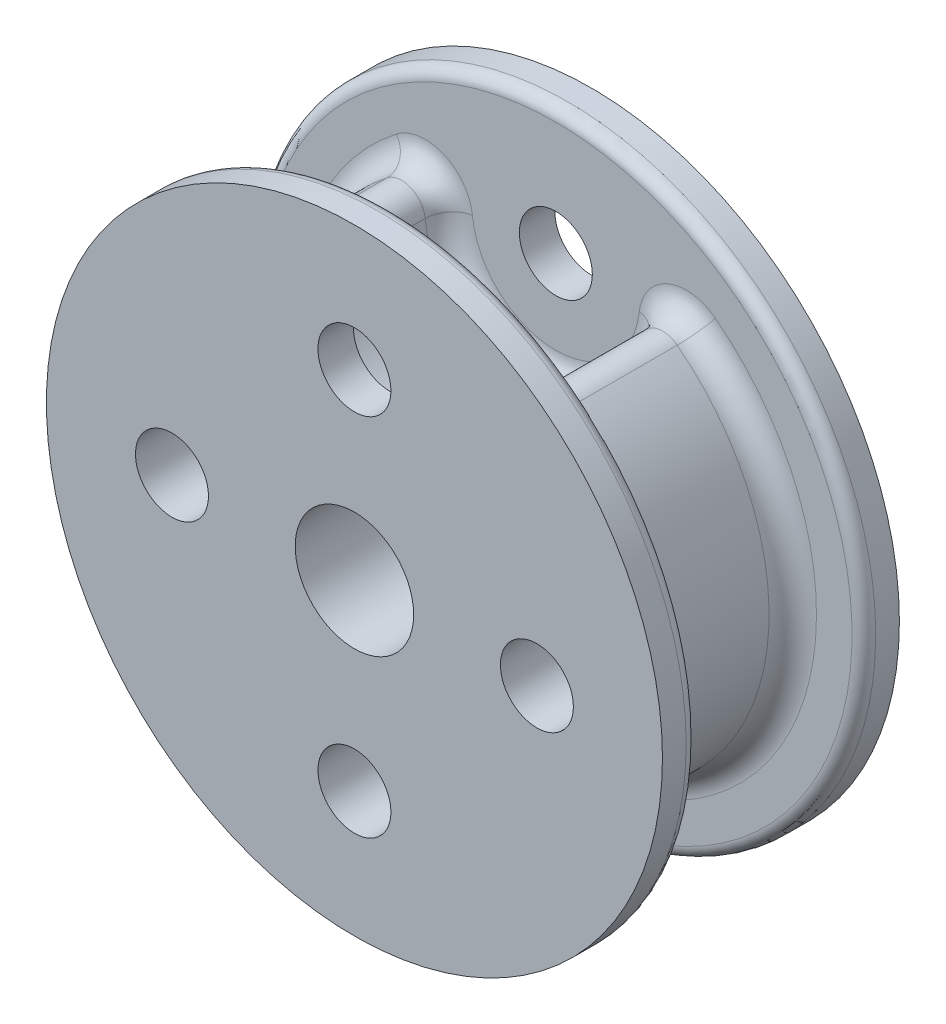
ISO-10303-21;
HEADER;
FILE_DESCRIPTION(('STEP AP214'),'2;1');
FILE_NAME('part.step','',(''),(''),'','','');
FILE_SCHEMA(('AUTOMOTIVE_DESIGN { 1 0 10303 214 1 1 1 1 }'));
ENDSEC;
DATA;
#1=APPLICATION_CONTEXT('core data for automotive mechanical design processes');
#2=APPLICATION_PROTOCOL_DEFINITION('international standard','automotive_design',2000,#1);
#3=PRODUCT_CONTEXT('',#1,'mechanical');
#4=PRODUCT('Part','Part','',(#3));
#5=PRODUCT_RELATED_PRODUCT_CATEGORY('part','',(#4));
#6=PRODUCT_DEFINITION_FORMATION('','',#4);
#7=PRODUCT_DEFINITION_CONTEXT('part definition',#1,'design');
#8=PRODUCT_DEFINITION('design','',#6,#7);
#9=PRODUCT_DEFINITION_SHAPE('','',#8);
#10=(LENGTH_UNIT() NAMED_UNIT(*) SI_UNIT(.MILLI.,.METRE.));
#11=(NAMED_UNIT(*) PLANE_ANGLE_UNIT() SI_UNIT($,.RADIAN.));
#12=(NAMED_UNIT(*) SI_UNIT($,.STERADIAN.) SOLID_ANGLE_UNIT());
#13=UNCERTAINTY_MEASURE_WITH_UNIT(LENGTH_MEASURE(1.E-05),#10,'distance_accuracy_value','');
#14=(GEOMETRIC_REPRESENTATION_CONTEXT(3) GLOBAL_UNCERTAINTY_ASSIGNED_CONTEXT((#13)) GLOBAL_UNIT_ASSIGNED_CONTEXT((#10,
#11,#12)) REPRESENTATION_CONTEXT('',''));
#15=CARTESIAN_POINT('',(0.,0.,0.));
#16=DIRECTION('',(0.,0.,1.));
#17=DIRECTION('',(1.,0.,0.));
#18=AXIS2_PLACEMENT_3D('',#15,#16,#17);
#19=CARTESIAN_POINT('',(0.,9.779,4.445));
#20=DIRECTION('',(0.,0.,-1.));
#21=DIRECTION('',(-1.,0.,0.));
#22=AXIS2_PLACEMENT_3D('',#19,#20,#21);
#23=CYLINDRICAL_SURFACE('',#22,5.7658);
#24=CARTESIAN_POINT('',(0.,9.779,3.175));
#25=DIRECTION('',(0.,0.,1.));
#26=DIRECTION('',(1.,0.,0.));
#27=AXIS2_PLACEMENT_3D('',#24,#25,#26);
#28=CIRCLE('',#27,5.7658);
#29=CARTESIAN_POINT('',(-5.73376060184355,9.17200823667307,3.175));
#30=VERTEX_POINT('',#29);
#31=CARTESIAN_POINT('',(5.73376060184355,9.17200823667307,3.175));
#32=VERTEX_POINT('',#31);
#33=EDGE_CURVE('E109',#30,#32,#28,.T.);
#34=ORIENTED_EDGE('',*,*,#33,.T.);
#35=DIRECTION('',(0.,0.,-1.));
#36=VECTOR('',#35,1.);
#37=CARTESIAN_POINT('',(5.73376060184355,9.17200823667307,4.445));
#38=LINE('',#37,#36);
#39=CARTESIAN_POINT('',(5.73376060184355,9.17200823667307,-3.175));
#40=VERTEX_POINT('',#39);
#41=EDGE_CURVE('E105',#32,#40,#38,.T.);
#42=ORIENTED_EDGE('',*,*,#41,.T.);
#43=CARTESIAN_POINT('',(0.,9.779,-3.175));
#44=DIRECTION('',(0.,0.,-1.));
#45=DIRECTION('',(-1.,0.,0.));
#46=AXIS2_PLACEMENT_3D('',#43,#44,#45);
#47=CIRCLE('',#46,5.7658);
#48=CARTESIAN_POINT('',(-5.73376060184355,9.17200823667307,-3.175));
#49=VERTEX_POINT('',#48);
#50=EDGE_CURVE('E98',#40,#49,#47,.T.);
#51=ORIENTED_EDGE('',*,*,#50,.T.);
#52=DIRECTION('',(0.,0.,-1.));
#53=VECTOR('',#52,1.);
#54=CARTESIAN_POINT('',(-5.73376060184355,9.17200823667307,4.445));
#55=LINE('',#54,#53);
#56=EDGE_CURVE('E102',#49,#30,#55,.F.);
#57=ORIENTED_EDGE('',*,*,#56,.T.);
#58=EDGE_LOOP('',(#34,#42,#51,#57));
#59=FACE_BOUND('',#58,.T.);
#60=ADVANCED_FACE('F35',(#59),#23,.F.);
#61=CARTESIAN_POINT('',(0.,-9.779,4.445));
#62=DIRECTION('',(0.,0.,-1.));
#63=DIRECTION('',(-1.,0.,0.));
#64=AXIS2_PLACEMENT_3D('',#61,#62,#63);
#65=CYLINDRICAL_SURFACE('',#64,1.9558);
#66=CARTESIAN_POINT('',(0.,-9.779,6.35));
#67=DIRECTION('',(0.,0.,1.));
#68=DIRECTION('',(1.,0.,0.));
#69=AXIS2_PLACEMENT_3D('',#66,#67,#68);
#70=CIRCLE('',#69,1.9558);
#71=CARTESIAN_POINT('',(1.9558,-9.779,6.35));
#72=VERTEX_POINT('',#71);
#73=EDGE_CURVE('E139',#72,#72,#70,.T.);
#74=ORIENTED_EDGE('',*,*,#73,.T.);
#75=EDGE_LOOP('',(#74));
#76=FACE_BOUND('',#75,.T.);
#77=CARTESIAN_POINT('',(0.,-9.779,-6.35));
#78=DIRECTION('',(0.,0.,1.));
#79=DIRECTION('',(1.,0.,0.));
#80=AXIS2_PLACEMENT_3D('',#77,#78,#79);
#81=CIRCLE('',#80,1.9558);
#82=CARTESIAN_POINT('',(1.9558,-9.779,-6.35));
#83=VERTEX_POINT('',#82);
#84=EDGE_CURVE('E321',#83,#83,#81,.T.);
#85=ORIENTED_EDGE('',*,*,#84,.F.);
#86=EDGE_LOOP('',(#85));
#87=FACE_BOUND('',#86,.T.);
#88=ADVANCED_FACE('F208',(#76,#87),#65,.F.);
#89=CARTESIAN_POINT('',(-9.779,0.,4.445));
#90=DIRECTION('',(0.,0.,-1.));
#91=DIRECTION('',(-1.,0.,0.));
#92=AXIS2_PLACEMENT_3D('',#89,#90,#91);
#93=CYLINDRICAL_SURFACE('',#92,1.9558);
#94=CARTESIAN_POINT('',(-9.779,0.,6.35));
#95=DIRECTION('',(0.,0.,1.));
#96=DIRECTION('',(1.,0.,0.));
#97=AXIS2_PLACEMENT_3D('',#94,#95,#96);
#98=CIRCLE('',#97,1.9558);
#99=CARTESIAN_POINT('',(-7.8232,0.,6.35));
#100=VERTEX_POINT('',#99);
#101=EDGE_CURVE('E304',#100,#100,#98,.T.);
#102=ORIENTED_EDGE('',*,*,#101,.T.);
#103=EDGE_LOOP('',(#102));
#104=FACE_BOUND('',#103,.T.);
#105=CARTESIAN_POINT('',(-9.779,0.,-6.35));
#106=DIRECTION('',(0.,0.,1.));
#107=DIRECTION('',(1.,0.,0.));
#108=AXIS2_PLACEMENT_3D('',#105,#106,#107);
#109=CIRCLE('',#108,1.9558);
#110=CARTESIAN_POINT('',(-7.8232,0.,-6.35));
#111=VERTEX_POINT('',#110);
#112=EDGE_CURVE('E307',#111,#111,#109,.T.);
#113=ORIENTED_EDGE('',*,*,#112,.F.);
#114=EDGE_LOOP('',(#113));
#115=FACE_BOUND('',#114,.T.);
#116=ADVANCED_FACE('F213',(#104,#115),#93,.F.);
#117=CARTESIAN_POINT('',(0.,0.,4.445));
#118=DIRECTION('',(0.,0.,-1.));
#119=DIRECTION('',(-1.,0.,0.));
#120=AXIS2_PLACEMENT_3D('',#117,#118,#119);
#121=CYLINDRICAL_SURFACE('',#120,12.7);
#122=DIRECTION('',(0.,0.,-1.));
#123=VECTOR('',#122,1.);
#124=CARTESIAN_POINT('',(-7.77411496187304,10.0425662337662,4.445));
#125=LINE('',#124,#123);
#126=CARTESIAN_POINT('',(-7.77411496187304,10.0425662337662,3.175));
#127=VERTEX_POINT('',#126);
#128=CARTESIAN_POINT('',(-7.77411496187304,10.0425662337662,-3.175));
#129=VERTEX_POINT('',#128);
#130=EDGE_CURVE('E55',#127,#129,#125,.T.);
#131=ORIENTED_EDGE('',*,*,#130,.T.);
#132=CARTESIAN_POINT('',(0.,0.,-3.175));
#133=DIRECTION('',(0.,0.,-1.));
#134=DIRECTION('',(-1.,0.,0.));
#135=AXIS2_PLACEMENT_3D('',#132,#133,#134);
#136=CIRCLE('',#135,12.7);
#137=CARTESIAN_POINT('',(7.77411496187304,10.0425662337662,-3.175));
#138=VERTEX_POINT('',#137);
#139=EDGE_CURVE('E50',#129,#138,#136,.F.);
#140=ORIENTED_EDGE('',*,*,#139,.T.);
#141=DIRECTION('',(0.,0.,-1.));
#142=VECTOR('',#141,1.);
#143=CARTESIAN_POINT('',(7.77411496187304,10.0425662337662,4.445));
#144=LINE('',#143,#142);
#145=CARTESIAN_POINT('',(7.77411496187304,10.0425662337662,3.175));
#146=VERTEX_POINT('',#145);
#147=EDGE_CURVE('E156',#138,#146,#144,.F.);
#148=ORIENTED_EDGE('',*,*,#147,.T.);
#149=CARTESIAN_POINT('',(0.,0.,3.175));
#150=DIRECTION('',(0.,0.,1.));
#151=DIRECTION('',(1.,0.,0.));
#152=AXIS2_PLACEMENT_3D('',#149,#150,#151);
#153=CIRCLE('',#152,12.7);
#154=EDGE_CURVE('E153',#146,#127,#153,.F.);
#155=ORIENTED_EDGE('',*,*,#154,.T.);
#156=EDGE_LOOP('',(#131,#140,#148,#155));
#157=FACE_BOUND('',#156,.T.);
#158=ADVANCED_FACE('F218',(#157),#121,.T.);
#159=CARTESIAN_POINT('',(0.,0.,4.445));
#160=DIRECTION('',(0.,0.,-1.));
#161=DIRECTION('',(-1.,0.,0.));
#162=AXIS2_PLACEMENT_3D('',#159,#160,#161);
#163=CYLINDRICAL_SURFACE('',#162,3.175);
#164=CARTESIAN_POINT('',(0.,0.,6.35));
#165=DIRECTION('',(0.,0.,1.));
#166=DIRECTION('',(1.,0.,0.));
#167=AXIS2_PLACEMENT_3D('',#164,#165,#166);
#168=CIRCLE('',#167,3.175);
#169=CARTESIAN_POINT('',(3.175,0.,6.35));
#170=VERTEX_POINT('',#169);
#171=EDGE_CURVE('E334',#170,#170,#168,.T.);
#172=ORIENTED_EDGE('',*,*,#171,.T.);
#173=EDGE_LOOP('',(#172));
#174=FACE_BOUND('',#173,.T.);
#175=CARTESIAN_POINT('',(0.,0.,-6.35));
#176=DIRECTION('',(0.,0.,1.));
#177=DIRECTION('',(1.,0.,0.));
#178=AXIS2_PLACEMENT_3D('',#175,#176,#177);
#179=CIRCLE('',#178,3.175);
#180=CARTESIAN_POINT('',(3.175,0.,-6.35));
#181=VERTEX_POINT('',#180);
#182=EDGE_CURVE('E309',#181,#181,#179,.T.);
#183=ORIENTED_EDGE('',*,*,#182,.F.);
#184=EDGE_LOOP('',(#183));
#185=FACE_BOUND('',#184,.T.);
#186=ADVANCED_FACE('F220',(#174,#185),#163,.F.);
#187=CARTESIAN_POINT('',(9.779,0.,4.445));
#188=DIRECTION('',(0.,0.,-1.));
#189=DIRECTION('',(-1.,0.,0.));
#190=AXIS2_PLACEMENT_3D('',#187,#188,#189);
#191=CYLINDRICAL_SURFACE('',#190,1.9558);
#192=CARTESIAN_POINT('',(9.779,0.,6.35));
#193=DIRECTION('',(0.,0.,1.));
#194=DIRECTION('',(1.,0.,0.));
#195=AXIS2_PLACEMENT_3D('',#192,#193,#194);
#196=CIRCLE('',#195,1.9558);
#197=CARTESIAN_POINT('',(11.7348,0.,6.35));
#198=VERTEX_POINT('',#197);
#199=EDGE_CURVE('E337',#198,#198,#196,.T.);
#200=ORIENTED_EDGE('',*,*,#199,.T.);
#201=EDGE_LOOP('',(#200));
#202=FACE_BOUND('',#201,.T.);
#203=CARTESIAN_POINT('',(9.779,0.,-6.35));
#204=DIRECTION('',(0.,0.,1.));
#205=DIRECTION('',(1.,0.,0.));
#206=AXIS2_PLACEMENT_3D('',#203,#204,#205);
#207=CIRCLE('',#206,1.9558);
#208=CARTESIAN_POINT('',(11.7348,0.,-6.35));
#209=VERTEX_POINT('',#208);
#210=EDGE_CURVE('E313',#209,#209,#207,.T.);
#211=ORIENTED_EDGE('',*,*,#210,.F.);
#212=EDGE_LOOP('',(#211));
#213=FACE_BOUND('',#212,.T.);
#214=ADVANCED_FACE('F223',(#202,#213),#191,.F.);
#215=CARTESIAN_POINT('',(0.,0.,4.445));
#216=DIRECTION('',(0.,0.,1.));
#217=DIRECTION('',(1.,0.,0.));
#218=AXIS2_PLACEMENT_3D('',#215,#216,#217);
#219=PLANE('',#218);
#220=CARTESIAN_POINT('',(0.,0.,4.445));
#221=DIRECTION('',(0.,0.,1.));
#222=DIRECTION('',(1.,0.,0.));
#223=AXIS2_PLACEMENT_3D('',#220,#221,#222);
#224=CIRCLE('',#223,15.875);
#225=CARTESIAN_POINT('',(15.875,0.,4.445));
#226=VERTEX_POINT('',#225);
#227=EDGE_CURVE('E190',#226,#226,#224,.F.);
#228=ORIENTED_EDGE('',*,*,#227,.T.);
#229=EDGE_LOOP('',(#228));
#230=FACE_BOUND('',#229,.T.);
#231=CARTESIAN_POINT('',(0.,0.,4.445));
#232=DIRECTION('',(0.,0.,1.));
#233=DIRECTION('',(1.,0.,0.));
#234=AXIS2_PLACEMENT_3D('',#231,#232,#233);
#235=CIRCLE('',#234,13.97);
#236=CARTESIAN_POINT('',(-8.55152645806035,11.0468228571429,4.445));
#237=VERTEX_POINT('',#236);
#238=CARTESIAN_POINT('',(8.55152645806035,11.0468228571429,4.445));
#239=VERTEX_POINT('',#238);
#240=EDGE_CURVE('E145',#237,#239,#235,.T.);
#241=ORIENTED_EDGE('',*,*,#240,.T.);
#242=CARTESIAN_POINT('',(6.99670346568574,9.03830961038961,4.445));
#243=DIRECTION('',(0.,0.,1.));
#244=DIRECTION('',(1.,0.,0.));
#245=AXIS2_PLACEMENT_3D('',#242,#243,#244);
#246=CIRCLE('',#245,2.54);
#247=CARTESIAN_POINT('',(4.47081773800136,9.30570686295654,4.445));
#248=VERTEX_POINT('',#247);
#249=EDGE_CURVE('E165',#239,#248,#246,.T.);
#250=ORIENTED_EDGE('',*,*,#249,.T.);
#251=CARTESIAN_POINT('',(0.,9.779,4.445));
#252=DIRECTION('',(0.,0.,1.));
#253=DIRECTION('',(1.,0.,0.));
#254=AXIS2_PLACEMENT_3D('',#251,#252,#253);
#255=CIRCLE('',#254,4.4958);
#256=CARTESIAN_POINT('',(-4.47081773800136,9.30570686295654,4.445));
#257=VERTEX_POINT('',#256);
#258=EDGE_CURVE('E147',#248,#257,#255,.F.);
#259=ORIENTED_EDGE('',*,*,#258,.T.);
#260=CARTESIAN_POINT('',(-6.99670346568574,9.03830961038961,4.445));
#261=DIRECTION('',(0.,0.,1.));
#262=DIRECTION('',(1.,0.,0.));
#263=AXIS2_PLACEMENT_3D('',#260,#261,#262);
#264=CIRCLE('',#263,2.54);
#265=EDGE_CURVE('E159',#257,#237,#264,.T.);
#266=ORIENTED_EDGE('',*,*,#265,.T.);
#267=EDGE_LOOP('',(#241,#250,#259,#266));
#268=FACE_BOUND('',#267,.T.);
#269=CARTESIAN_POINT('',(0.,9.779,4.445));
#270=DIRECTION('',(0.,0.,1.));
#271=DIRECTION('',(1.,0.,0.));
#272=AXIS2_PLACEMENT_3D('',#269,#270,#271);
#273=CIRCLE('',#272,1.9558);
#274=CARTESIAN_POINT('',(1.9558,9.779,4.445));
#275=VERTEX_POINT('',#274);
#276=EDGE_CURVE('E327',#275,#275,#273,.T.);
#277=ORIENTED_EDGE('',*,*,#276,.T.);
#278=EDGE_LOOP('',(#277));
#279=FACE_BOUND('',#278,.T.);
#280=ADVANCED_FACE('F286',(#230,#268,#279),#219,.F.);
#281=CARTESIAN_POINT('',(0.,0.,6.35));
#282=DIRECTION('',(0.,0.,1.));
#283=DIRECTION('',(1.,0.,0.));
#284=AXIS2_PLACEMENT_3D('',#281,#282,#283);
#285=PLANE('',#284);
#286=ORIENTED_EDGE('',*,*,#101,.F.);
#287=EDGE_LOOP('',(#286));
#288=FACE_BOUND('',#287,.T.);
#289=ORIENTED_EDGE('',*,*,#199,.F.);
#290=EDGE_LOOP('',(#289));
#291=FACE_BOUND('',#290,.T.);
#292=CARTESIAN_POINT('',(0.,0.,6.35));
#293=DIRECTION('',(0.,0.,1.));
#294=DIRECTION('',(1.,0.,0.));
#295=AXIS2_PLACEMENT_3D('',#292,#293,#294);
#296=CIRCLE('',#295,16.51);
#297=CARTESIAN_POINT('',(16.51,0.,6.35));
#298=VERTEX_POINT('',#297);
#299=EDGE_CURVE('E136',#298,#298,#296,.T.);
#300=ORIENTED_EDGE('',*,*,#299,.T.);
#301=EDGE_LOOP('',(#300));
#302=FACE_BOUND('',#301,.T.);
#303=ORIENTED_EDGE('',*,*,#73,.F.);
#304=EDGE_LOOP('',(#303));
#305=FACE_BOUND('',#304,.T.);
#306=ORIENTED_EDGE('',*,*,#171,.F.);
#307=EDGE_LOOP('',(#306));
#308=FACE_BOUND('',#307,.T.);
#309=CARTESIAN_POINT('',(0.,9.779,6.35));
#310=DIRECTION('',(0.,0.,1.));
#311=DIRECTION('',(1.,0.,0.));
#312=AXIS2_PLACEMENT_3D('',#309,#310,#311);
#313=CIRCLE('',#312,1.9558);
#314=CARTESIAN_POINT('',(1.9558,9.779,6.35));
#315=VERTEX_POINT('',#314);
#316=EDGE_CURVE('E328',#315,#315,#313,.T.);
#317=ORIENTED_EDGE('',*,*,#316,.F.);
#318=EDGE_LOOP('',(#317));
#319=FACE_BOUND('',#318,.T.);
#320=ADVANCED_FACE('F283',(#288,#291,#302,#305,#308,#319),#285,.T.);
#321=CARTESIAN_POINT('',(0.,0.,6.35));
#322=DIRECTION('',(0.,0.,-1.));
#323=DIRECTION('',(-1.,0.,0.));
#324=AXIS2_PLACEMENT_3D('',#321,#322,#323);
#325=CYLINDRICAL_SURFACE('',#324,16.51);
#326=CARTESIAN_POINT('',(0.,0.,5.08));
#327=DIRECTION('',(0.,0.,1.));
#328=DIRECTION('',(1.,0.,0.));
#329=AXIS2_PLACEMENT_3D('',#326,#327,#328);
#330=CIRCLE('',#329,16.51);
#331=CARTESIAN_POINT('',(16.51,0.,5.08));
#332=VERTEX_POINT('',#331);
#333=EDGE_CURVE('E167',#332,#332,#330,.T.);
#334=ORIENTED_EDGE('',*,*,#333,.T.);
#335=EDGE_LOOP('',(#334));
#336=FACE_BOUND('',#335,.T.);
#337=ORIENTED_EDGE('',*,*,#299,.F.);
#338=EDGE_LOOP('',(#337));
#339=FACE_BOUND('',#338,.T.);
#340=ADVANCED_FACE('F281',(#336,#339),#325,.T.);
#341=CARTESIAN_POINT('',(0.,9.779,6.35));
#342=DIRECTION('',(0.,0.,-1.));
#343=DIRECTION('',(-1.,0.,0.));
#344=AXIS2_PLACEMENT_3D('',#341,#342,#343);
#345=CYLINDRICAL_SURFACE('',#344,1.9558);
#346=ORIENTED_EDGE('',*,*,#316,.T.);
#347=EDGE_LOOP('',(#346));
#348=FACE_BOUND('',#347,.T.);
#349=ORIENTED_EDGE('',*,*,#276,.F.);
#350=EDGE_LOOP('',(#349));
#351=FACE_BOUND('',#350,.T.);
#352=ADVANCED_FACE('F275',(#348,#351),#345,.F.);
#353=CARTESIAN_POINT('',(0.,0.,-4.445));
#354=DIRECTION('',(0.,0.,-1.));
#355=DIRECTION('',(1.,0.,0.));
#356=AXIS2_PLACEMENT_3D('',#353,#354,#355);
#357=PLANE('',#356);
#358=CARTESIAN_POINT('',(0.,0.,-4.445));
#359=DIRECTION('',(0.,0.,-1.));
#360=DIRECTION('',(-1.,0.,0.));
#361=AXIS2_PLACEMENT_3D('',#358,#359,#360);
#362=CIRCLE('',#361,15.875);
#363=CARTESIAN_POINT('',(-15.875,0.,-4.445));
#364=VERTEX_POINT('',#363);
#365=EDGE_CURVE('E43',#364,#364,#362,.F.);
#366=ORIENTED_EDGE('',*,*,#365,.T.);
#367=EDGE_LOOP('',(#366));
#368=FACE_BOUND('',#367,.T.);
#369=CARTESIAN_POINT('',(0.,0.,-4.445));
#370=DIRECTION('',(0.,0.,-1.));
#371=DIRECTION('',(-1.,0.,0.));
#372=AXIS2_PLACEMENT_3D('',#369,#370,#371);
#373=CIRCLE('',#372,13.97);
#374=CARTESIAN_POINT('',(8.55152645806035,11.0468228571429,-4.445));
#375=VERTEX_POINT('',#374);
#376=CARTESIAN_POINT('',(-8.55152645806035,11.0468228571429,-4.445));
#377=VERTEX_POINT('',#376);
#378=EDGE_CURVE('E150',#375,#377,#373,.T.);
#379=ORIENTED_EDGE('',*,*,#378,.T.);
#380=CARTESIAN_POINT('',(-6.99670346568574,9.03830961038961,-4.445));
#381=DIRECTION('',(0.,0.,-1.));
#382=DIRECTION('',(-1.,0.,0.));
#383=AXIS2_PLACEMENT_3D('',#380,#381,#382);
#384=CIRCLE('',#383,2.54);
#385=CARTESIAN_POINT('',(-4.47081773800136,9.30570686295654,-4.445));
#386=VERTEX_POINT('',#385);
#387=EDGE_CURVE('E163',#377,#386,#384,.T.);
#388=ORIENTED_EDGE('',*,*,#387,.T.);
#389=CARTESIAN_POINT('',(0.,9.779,-4.445));
#390=DIRECTION('',(0.,0.,-1.));
#391=DIRECTION('',(-1.,0.,0.));
#392=AXIS2_PLACEMENT_3D('',#389,#390,#391);
#393=CIRCLE('',#392,4.4958);
#394=CARTESIAN_POINT('',(4.47081773800136,9.30570686295654,-4.445));
#395=VERTEX_POINT('',#394);
#396=EDGE_CURVE('E117',#386,#395,#393,.F.);
#397=ORIENTED_EDGE('',*,*,#396,.T.);
#398=CARTESIAN_POINT('',(6.99670346568574,9.03830961038961,-4.445));
#399=DIRECTION('',(0.,0.,-1.));
#400=DIRECTION('',(-1.,0.,0.));
#401=AXIS2_PLACEMENT_3D('',#398,#399,#400);
#402=CIRCLE('',#401,2.54);
#403=EDGE_CURVE('E161',#395,#375,#402,.T.);
#404=ORIENTED_EDGE('',*,*,#403,.T.);
#405=EDGE_LOOP('',(#379,#388,#397,#404));
#406=FACE_BOUND('',#405,.T.);
#407=CARTESIAN_POINT('',(0.,9.779,-4.445));
#408=DIRECTION('',(0.,0.,1.));
#409=DIRECTION('',(1.,0.,0.));
#410=AXIS2_PLACEMENT_3D('',#407,#408,#409);
#411=CIRCLE('',#410,1.9558);
#412=CARTESIAN_POINT('',(1.9558,9.779,-4.445));
#413=VERTEX_POINT('',#412);
#414=EDGE_CURVE('E187',#413,#413,#411,.T.);
#415=ORIENTED_EDGE('',*,*,#414,.F.);
#416=EDGE_LOOP('',(#415));
#417=FACE_BOUND('',#416,.T.);
#418=ADVANCED_FACE('F195',(#368,#406,#417),#357,.F.);
#419=CARTESIAN_POINT('',(0.,0.,-6.35));
#420=DIRECTION('',(0.,0.,1.));
#421=DIRECTION('',(1.,0.,0.));
#422=AXIS2_PLACEMENT_3D('',#419,#420,#421);
#423=CYLINDRICAL_SURFACE('',#422,16.51);
#424=CARTESIAN_POINT('',(0.,0.,-5.08));
#425=DIRECTION('',(0.,0.,-1.));
#426=DIRECTION('',(-1.,0.,0.));
#427=AXIS2_PLACEMENT_3D('',#424,#425,#426);
#428=CIRCLE('',#427,16.51);
#429=CARTESIAN_POINT('',(-16.51,0.,-5.08));
#430=VERTEX_POINT('',#429);
#431=EDGE_CURVE('E11',#430,#430,#428,.T.);
#432=ORIENTED_EDGE('',*,*,#431,.T.);
#433=EDGE_LOOP('',(#432));
#434=FACE_BOUND('',#433,.T.);
#435=CARTESIAN_POINT('',(0.,0.,-6.35));
#436=DIRECTION('',(0.,0.,1.));
#437=DIRECTION('',(1.,0.,0.));
#438=AXIS2_PLACEMENT_3D('',#435,#436,#437);
#439=CIRCLE('',#438,16.51);
#440=CARTESIAN_POINT('',(16.51,0.,-6.35));
#441=VERTEX_POINT('',#440);
#442=EDGE_CURVE('E324',#441,#441,#439,.T.);
#443=ORIENTED_EDGE('',*,*,#442,.T.);
#444=EDGE_LOOP('',(#443));
#445=FACE_BOUND('',#444,.T.);
#446=ADVANCED_FACE('F267',(#434,#445),#423,.T.);
#447=CARTESIAN_POINT('',(0.,0.,-6.35));
#448=DIRECTION('',(0.,0.,-1.));
#449=DIRECTION('',(1.,0.,0.));
#450=AXIS2_PLACEMENT_3D('',#447,#448,#449);
#451=PLANE('',#450);
#452=CARTESIAN_POINT('',(0.,9.779,-6.35));
#453=DIRECTION('',(0.,0.,1.));
#454=DIRECTION('',(1.,0.,0.));
#455=AXIS2_PLACEMENT_3D('',#452,#453,#454);
#456=CIRCLE('',#455,1.9558);
#457=CARTESIAN_POINT('',(1.9558,9.779,-6.35));
#458=VERTEX_POINT('',#457);
#459=EDGE_CURVE('E310',#458,#458,#456,.T.);
#460=ORIENTED_EDGE('',*,*,#459,.T.);
#461=EDGE_LOOP('',(#460));
#462=FACE_BOUND('',#461,.T.);
#463=ORIENTED_EDGE('',*,*,#112,.T.);
#464=EDGE_LOOP('',(#463));
#465=FACE_BOUND('',#464,.T.);
#466=ORIENTED_EDGE('',*,*,#182,.T.);
#467=EDGE_LOOP('',(#466));
#468=FACE_BOUND('',#467,.T.);
#469=ORIENTED_EDGE('',*,*,#210,.T.);
#470=EDGE_LOOP('',(#469));
#471=FACE_BOUND('',#470,.T.);
#472=ORIENTED_EDGE('',*,*,#84,.T.);
#473=EDGE_LOOP('',(#472));
#474=FACE_BOUND('',#473,.T.);
#475=ORIENTED_EDGE('',*,*,#442,.F.);
#476=EDGE_LOOP('',(#475));
#477=FACE_BOUND('',#476,.T.);
#478=ADVANCED_FACE('F261',(#462,#465,#468,#471,#474,#477),#451,.T.);
#479=CARTESIAN_POINT('',(0.,9.779,-6.35));
#480=DIRECTION('',(0.,0.,1.));
#481=DIRECTION('',(1.,0.,0.));
#482=AXIS2_PLACEMENT_3D('',#479,#480,#481);
#483=CYLINDRICAL_SURFACE('',#482,1.9558);
#484=ORIENTED_EDGE('',*,*,#459,.F.);
#485=EDGE_LOOP('',(#484));
#486=FACE_BOUND('',#485,.T.);
#487=ORIENTED_EDGE('',*,*,#414,.T.);
#488=EDGE_LOOP('',(#487));
#489=FACE_BOUND('',#488,.T.);
#490=ADVANCED_FACE('F257',(#486,#489),#483,.F.);
#491=CARTESIAN_POINT('',(0.,9.779,-3.175));
#492=DIRECTION('',(0.,0.,-1.));
#493=DIRECTION('',(-1.,0.,0.));
#494=AXIS2_PLACEMENT_3D('',#491,#492,#493);
#495=TOROIDAL_SURFACE('',#494,4.4958,1.27);
#496=CARTESIAN_POINT('',(4.47081773800136,9.30570686295654,-3.175));
#497=DIRECTION('',(-0.105274508884617,-0.994443199875741,0.));
#498=DIRECTION('',(0.994443199875741,-0.105274508884617,0.));
#499=AXIS2_PLACEMENT_3D('',#496,#497,#498);
#500=CIRCLE('',#499,1.27);
#501=EDGE_CURVE('E121',#395,#40,#500,.T.);
#502=ORIENTED_EDGE('',*,*,#501,.F.);
#503=ORIENTED_EDGE('',*,*,#396,.F.);
#504=CARTESIAN_POINT('',(-4.47081773800136,9.30570686295654,-3.175));
#505=DIRECTION('',(0.105274508884617,-0.994443199875741,0.));
#506=DIRECTION('',(0.994443199875741,0.105274508884617,0.));
#507=AXIS2_PLACEMENT_3D('',#504,#505,#506);
#508=CIRCLE('',#507,1.27);
#509=EDGE_CURVE('E113',#49,#386,#508,.T.);
#510=ORIENTED_EDGE('',*,*,#509,.F.);
#511=ORIENTED_EDGE('',*,*,#50,.F.);
#512=EDGE_LOOP('',(#502,#503,#510,#511));
#513=FACE_BOUND('',#512,.T.);
#514=ADVANCED_FACE('F115',(#513),#495,.F.);
#515=CARTESIAN_POINT('',(0.,0.,-3.175));
#516=DIRECTION('',(0.,0.,-1.));
#517=DIRECTION('',(-1.,0.,0.));
#518=AXIS2_PLACEMENT_3D('',#515,#516,#517);
#519=TOROIDAL_SURFACE('',#518,13.97,1.27);
#520=CARTESIAN_POINT('',(-8.55152645806035,11.0468228571429,-3.175));
#521=DIRECTION('',(-0.790753246753247,-0.612135036367956,0.));
#522=DIRECTION('',(0.612135036367956,-0.790753246753247,0.));
#523=AXIS2_PLACEMENT_3D('',#520,#521,#522);
#524=CIRCLE('',#523,1.27);
#525=EDGE_CURVE('E120',#377,#129,#524,.T.);
#526=ORIENTED_EDGE('',*,*,#525,.F.);
#527=ORIENTED_EDGE('',*,*,#378,.F.);
#528=CARTESIAN_POINT('',(8.55152645806035,11.0468228571429,-3.175));
#529=DIRECTION('',(0.790753246753247,-0.612135036367956,0.));
#530=DIRECTION('',(0.612135036367956,0.790753246753247,0.));
#531=AXIS2_PLACEMENT_3D('',#528,#529,#530);
#532=CIRCLE('',#531,1.27);
#533=EDGE_CURVE('E129',#138,#375,#532,.T.);
#534=ORIENTED_EDGE('',*,*,#533,.F.);
#535=ORIENTED_EDGE('',*,*,#139,.F.);
#536=EDGE_LOOP('',(#526,#527,#534,#535));
#537=FACE_BOUND('',#536,.T.);
#538=ADVANCED_FACE('F252',(#537),#519,.F.);
#539=CARTESIAN_POINT('',(-6.99670346568574,9.03830961038961,-3.175));
#540=DIRECTION('',(0.,0.,-1.));
#541=DIRECTION('',(-1.,0.,0.));
#542=AXIS2_PLACEMENT_3D('',#539,#540,#541);
#543=TOROIDAL_SURFACE('',#542,2.54,1.27);
#544=ORIENTED_EDGE('',*,*,#387,.F.);
#545=ORIENTED_EDGE('',*,*,#525,.T.);
#546=CARTESIAN_POINT('',(-6.99670346568574,9.03830961038961,-3.175));
#547=DIRECTION('',(0.,0.,-1.));
#548=DIRECTION('',(-1.,0.,0.));
#549=AXIS2_PLACEMENT_3D('',#546,#547,#548);
#550=CIRCLE('',#549,1.27);
#551=EDGE_CURVE('E125',#49,#129,#550,.F.);
#552=ORIENTED_EDGE('',*,*,#551,.F.);
#553=ORIENTED_EDGE('',*,*,#509,.T.);
#554=EDGE_LOOP('',(#544,#545,#552,#553));
#555=FACE_BOUND('',#554,.T.);
#556=ADVANCED_FACE('F126',(#555),#543,.F.);
#557=CARTESIAN_POINT('',(6.99670346568574,9.03830961038961,-3.175));
#558=DIRECTION('',(0.,0.,-1.));
#559=DIRECTION('',(-1.,0.,0.));
#560=AXIS2_PLACEMENT_3D('',#557,#558,#559);
#561=TOROIDAL_SURFACE('',#560,2.54,1.27);
#562=ORIENTED_EDGE('',*,*,#403,.F.);
#563=ORIENTED_EDGE('',*,*,#501,.T.);
#564=CARTESIAN_POINT('',(6.99670346568574,9.03830961038961,-3.175));
#565=DIRECTION('',(0.,0.,-1.));
#566=DIRECTION('',(-1.,0.,0.));
#567=AXIS2_PLACEMENT_3D('',#564,#565,#566);
#568=CIRCLE('',#567,1.27);
#569=EDGE_CURVE('E130',#138,#40,#568,.F.);
#570=ORIENTED_EDGE('',*,*,#569,.F.);
#571=ORIENTED_EDGE('',*,*,#533,.T.);
#572=EDGE_LOOP('',(#562,#563,#570,#571));
#573=FACE_BOUND('',#572,.T.);
#574=ADVANCED_FACE('F246',(#573),#561,.F.);
#575=CARTESIAN_POINT('',(-6.99670346568574,9.03830961038961,4.445));
#576=DIRECTION('',(0.,0.,1.));
#577=DIRECTION('',(1.,0.,0.));
#578=AXIS2_PLACEMENT_3D('',#575,#576,#577);
#579=CYLINDRICAL_SURFACE('',#578,1.27);
#580=ORIENTED_EDGE('',*,*,#551,.T.);
#581=ORIENTED_EDGE('',*,*,#130,.F.);
#582=CARTESIAN_POINT('',(-6.99670346568574,9.03830961038961,3.175));
#583=DIRECTION('',(0.,0.,1.));
#584=DIRECTION('',(1.,0.,0.));
#585=AXIS2_PLACEMENT_3D('',#582,#583,#584);
#586=CIRCLE('',#585,1.27);
#587=EDGE_CURVE('E134',#30,#127,#586,.T.);
#588=ORIENTED_EDGE('',*,*,#587,.F.);
#589=ORIENTED_EDGE('',*,*,#56,.F.);
#590=EDGE_LOOP('',(#580,#581,#588,#589));
#591=FACE_BOUND('',#590,.T.);
#592=ADVANCED_FACE('F132',(#591),#579,.T.);
#593=CARTESIAN_POINT('',(6.99670346568574,9.03830961038961,4.445));
#594=DIRECTION('',(0.,0.,1.));
#595=DIRECTION('',(1.,0.,0.));
#596=AXIS2_PLACEMENT_3D('',#593,#594,#595);
#597=CYLINDRICAL_SURFACE('',#596,1.27);
#598=ORIENTED_EDGE('',*,*,#569,.T.);
#599=ORIENTED_EDGE('',*,*,#41,.F.);
#600=CARTESIAN_POINT('',(6.99670346568574,9.03830961038961,3.175));
#601=DIRECTION('',(0.,0.,1.));
#602=DIRECTION('',(1.,0.,0.));
#603=AXIS2_PLACEMENT_3D('',#600,#601,#602);
#604=CIRCLE('',#603,1.27);
#605=EDGE_CURVE('E174',#146,#32,#604,.T.);
#606=ORIENTED_EDGE('',*,*,#605,.F.);
#607=ORIENTED_EDGE('',*,*,#147,.F.);
#608=EDGE_LOOP('',(#598,#599,#606,#607));
#609=FACE_BOUND('',#608,.T.);
#610=ADVANCED_FACE('F239',(#609),#597,.T.);
#611=CARTESIAN_POINT('',(0.,0.,3.175));
#612=DIRECTION('',(0.,0.,1.));
#613=DIRECTION('',(1.,0.,0.));
#614=AXIS2_PLACEMENT_3D('',#611,#612,#613);
#615=TOROIDAL_SURFACE('',#614,13.97,1.27);
#616=CARTESIAN_POINT('',(8.55152645806035,11.0468228571429,3.175));
#617=DIRECTION('',(0.790753246753247,-0.612135036367956,0.));
#618=DIRECTION('',(0.612135036367956,0.790753246753247,0.));
#619=AXIS2_PLACEMENT_3D('',#616,#617,#618);
#620=CIRCLE('',#619,1.27);
#621=EDGE_CURVE('E172',#239,#146,#620,.T.);
#622=ORIENTED_EDGE('',*,*,#621,.F.);
#623=ORIENTED_EDGE('',*,*,#240,.F.);
#624=CARTESIAN_POINT('',(-8.55152645806035,11.0468228571429,3.175));
#625=DIRECTION('',(-0.790753246753247,-0.612135036367956,0.));
#626=DIRECTION('',(0.612135036367956,-0.790753246753247,0.));
#627=AXIS2_PLACEMENT_3D('',#624,#625,#626);
#628=CIRCLE('',#627,1.27);
#629=EDGE_CURVE('E178',#127,#237,#628,.T.);
#630=ORIENTED_EDGE('',*,*,#629,.F.);
#631=ORIENTED_EDGE('',*,*,#154,.F.);
#632=EDGE_LOOP('',(#622,#623,#630,#631));
#633=FACE_BOUND('',#632,.T.);
#634=ADVANCED_FACE('F235',(#633),#615,.F.);
#635=CARTESIAN_POINT('',(-6.99670346568574,9.03830961038961,3.175));
#636=DIRECTION('',(0.,0.,1.));
#637=DIRECTION('',(1.,0.,0.));
#638=AXIS2_PLACEMENT_3D('',#635,#636,#637);
#639=TOROIDAL_SURFACE('',#638,2.54,1.27);
#640=ORIENTED_EDGE('',*,*,#629,.T.);
#641=ORIENTED_EDGE('',*,*,#265,.F.);
#642=CARTESIAN_POINT('',(-4.47081773800136,9.30570686295654,3.175));
#643=DIRECTION('',(0.105274508884617,-0.994443199875741,0.));
#644=DIRECTION('',(0.994443199875741,0.105274508884617,0.));
#645=AXIS2_PLACEMENT_3D('',#642,#643,#644);
#646=CIRCLE('',#645,1.27);
#647=EDGE_CURVE('E170',#30,#257,#646,.F.);
#648=ORIENTED_EDGE('',*,*,#647,.F.);
#649=ORIENTED_EDGE('',*,*,#587,.T.);
#650=EDGE_LOOP('',(#640,#641,#648,#649));
#651=FACE_BOUND('',#650,.T.);
#652=ADVANCED_FACE('F231',(#651),#639,.F.);
#653=CARTESIAN_POINT('',(6.99670346568574,9.03830961038961,3.175));
#654=DIRECTION('',(0.,0.,1.));
#655=DIRECTION('',(1.,0.,0.));
#656=AXIS2_PLACEMENT_3D('',#653,#654,#655);
#657=TOROIDAL_SURFACE('',#656,2.54,1.27);
#658=ORIENTED_EDGE('',*,*,#621,.T.);
#659=ORIENTED_EDGE('',*,*,#605,.T.);
#660=CARTESIAN_POINT('',(4.47081773800136,9.30570686295654,3.175));
#661=DIRECTION('',(-0.105274508884617,-0.994443199875741,0.));
#662=DIRECTION('',(0.994443199875741,-0.105274508884617,0.));
#663=AXIS2_PLACEMENT_3D('',#660,#661,#662);
#664=CIRCLE('',#663,1.27);
#665=EDGE_CURVE('E168',#248,#32,#664,.F.);
#666=ORIENTED_EDGE('',*,*,#665,.F.);
#667=ORIENTED_EDGE('',*,*,#249,.F.);
#668=EDGE_LOOP('',(#658,#659,#666,#667));
#669=FACE_BOUND('',#668,.T.);
#670=ADVANCED_FACE('F227',(#669),#657,.F.);
#671=CARTESIAN_POINT('',(0.,9.779,3.175));
#672=DIRECTION('',(0.,0.,1.));
#673=DIRECTION('',(1.,0.,0.));
#674=AXIS2_PLACEMENT_3D('',#671,#672,#673);
#675=TOROIDAL_SURFACE('',#674,4.4958,1.27);
#676=ORIENTED_EDGE('',*,*,#647,.T.);
#677=ORIENTED_EDGE('',*,*,#258,.F.);
#678=ORIENTED_EDGE('',*,*,#665,.T.);
#679=ORIENTED_EDGE('',*,*,#33,.F.);
#680=EDGE_LOOP('',(#676,#677,#678,#679));
#681=FACE_BOUND('',#680,.T.);
#682=ADVANCED_FACE('F204',(#681),#675,.F.);
#683=CARTESIAN_POINT('',(0.,0.,5.08));
#684=DIRECTION('',(0.,0.,1.));
#685=DIRECTION('',(1.,0.,0.));
#686=AXIS2_PLACEMENT_3D('',#683,#684,#685);
#687=TOROIDAL_SURFACE('',#686,15.875,0.635);
#688=ORIENTED_EDGE('',*,*,#227,.F.);
#689=EDGE_LOOP('',(#688));
#690=FACE_BOUND('',#689,.T.);
#691=ORIENTED_EDGE('',*,*,#333,.F.);
#692=EDGE_LOOP('',(#691));
#693=FACE_BOUND('',#692,.T.);
#694=ADVANCED_FACE('F199',(#690,#693),#687,.T.);
#695=CARTESIAN_POINT('',(0.,0.,-5.08));
#696=DIRECTION('',(0.,0.,-1.));
#697=DIRECTION('',(-1.,0.,0.));
#698=AXIS2_PLACEMENT_3D('',#695,#696,#697);
#699=TOROIDAL_SURFACE('',#698,15.875,0.635);
#700=ORIENTED_EDGE('',*,*,#431,.F.);
#701=EDGE_LOOP('',(#700));
#702=FACE_BOUND('',#701,.T.);
#703=ORIENTED_EDGE('',*,*,#365,.F.);
#704=EDGE_LOOP('',(#703));
#705=FACE_BOUND('',#704,.T.);
#706=ADVANCED_FACE('F37',(#702,#705),#699,.T.);
#707=CLOSED_SHELL('',(#60,#88,#116,#158,#186,#214,#280,#320,#340,#352,#418,#446,#478,#490,#514,
#538,#556,#574,#592,#610,#634,#652,#670,#682,#694,#706));
#708=MANIFOLD_SOLID_BREP('B2',#707);
#709=ADVANCED_BREP_SHAPE_REPRESENTATION('',(#18,#708),#14);
#710=SHAPE_DEFINITION_REPRESENTATION(#9,#709);
ENDSEC;
END-ISO-10303-21;
